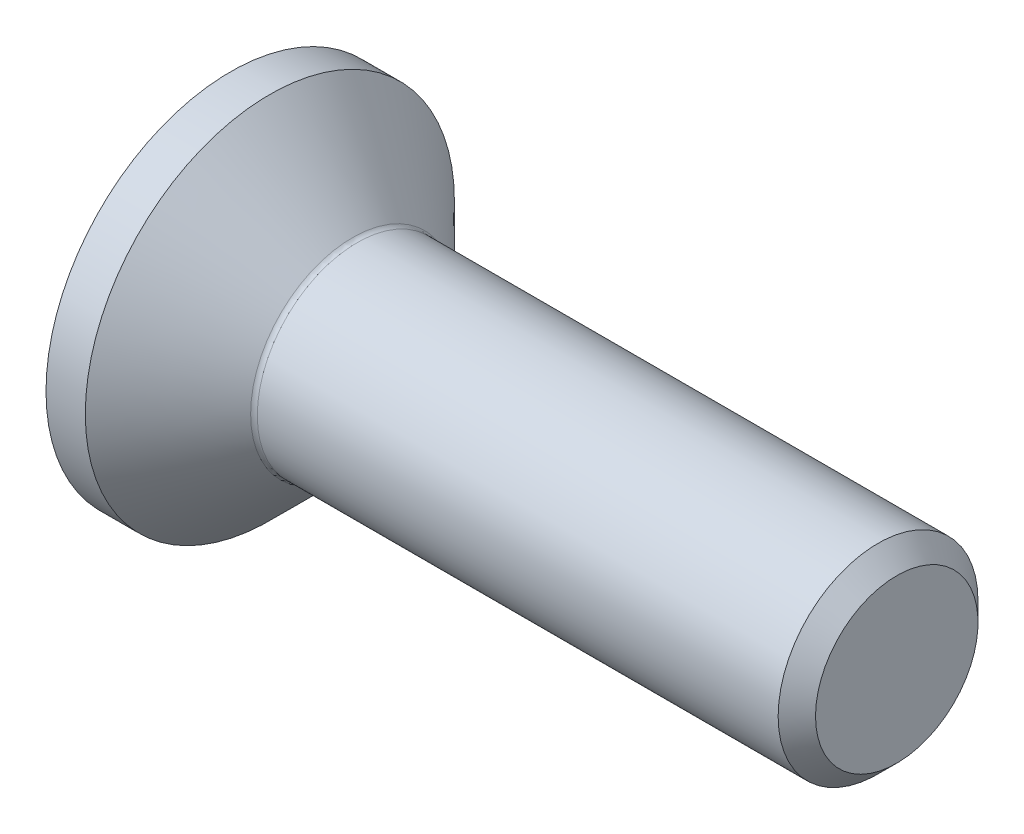
ISO-10303-21;
HEADER;
FILE_DESCRIPTION(('STEP AP214'),'2;1');
FILE_NAME('part.step','',(''),(''),'','','');
FILE_SCHEMA(('AUTOMOTIVE_DESIGN { 1 0 10303 214 1 1 1 1 }'));
ENDSEC;
DATA;
#1=APPLICATION_CONTEXT('core data for automotive mechanical design processes');
#2=APPLICATION_PROTOCOL_DEFINITION('international standard','automotive_design',2000,#1);
#3=PRODUCT_CONTEXT('',#1,'mechanical');
#4=PRODUCT('Part','Part','',(#3));
#5=PRODUCT_RELATED_PRODUCT_CATEGORY('part','',(#4));
#6=PRODUCT_DEFINITION_FORMATION('','',#4);
#7=PRODUCT_DEFINITION_CONTEXT('part definition',#1,'design');
#8=PRODUCT_DEFINITION('design','',#6,#7);
#9=PRODUCT_DEFINITION_SHAPE('','',#8);
#10=(LENGTH_UNIT() NAMED_UNIT(*) SI_UNIT(.MILLI.,.METRE.));
#11=(NAMED_UNIT(*) PLANE_ANGLE_UNIT() SI_UNIT($,.RADIAN.));
#12=(NAMED_UNIT(*) SI_UNIT($,.STERADIAN.) SOLID_ANGLE_UNIT());
#13=UNCERTAINTY_MEASURE_WITH_UNIT(LENGTH_MEASURE(1.E-05),#10,'distance_accuracy_value','');
#14=(GEOMETRIC_REPRESENTATION_CONTEXT(3) GLOBAL_UNCERTAINTY_ASSIGNED_CONTEXT((#13)) GLOBAL_UNIT_ASSIGNED_CONTEXT((#10,
#11,#12)) REPRESENTATION_CONTEXT('',''));
#15=CARTESIAN_POINT('',(0.,0.,0.));
#16=DIRECTION('',(0.,0.,1.));
#17=DIRECTION('',(1.,0.,0.));
#18=AXIS2_PLACEMENT_3D('',#15,#16,#17);
#19=CARTESIAN_POINT('',(0.,0.,0.));
#20=DIRECTION('',(-1.,0.,0.));
#21=DIRECTION('',(0.,0.,1.));
#22=AXIS2_PLACEMENT_3D('',#19,#20,#21);
#23=PLANE('',#22);
#24=CARTESIAN_POINT('',(0.,0.,0.));
#25=DIRECTION('',(-1.,0.,0.));
#26=DIRECTION('',(0.,0.,1.));
#27=AXIS2_PLACEMENT_3D('',#24,#25,#26);
#28=CIRCLE('',#27,2.77);
#29=CARTESIAN_POINT('',(0.,0.,2.77));
#30=VERTEX_POINT('',#29);
#31=EDGE_CURVE('E153',#30,#30,#28,.T.);
#32=ORIENTED_EDGE('',*,*,#31,.T.);
#33=EDGE_LOOP('',(#32));
#34=FACE_BOUND('',#33,.T.);
#35=DIRECTION('',(0.,-0.5,-0.866025403784439));
#36=VECTOR('',#35,1.);
#37=CARTESIAN_POINT('',(0.,-0.577350269189626,1.));
#38=LINE('',#37,#36);
#39=CARTESIAN_POINT('',(0.,-0.577350269189626,1.));
#40=VERTEX_POINT('',#39);
#41=CARTESIAN_POINT('',(0.,-1.15470053837925,0.));
#42=VERTEX_POINT('',#41);
#43=EDGE_CURVE('E119',#40,#42,#38,.T.);
#44=ORIENTED_EDGE('',*,*,#43,.T.);
#45=DIRECTION('',(0.,0.5,-0.866025403784439));
#46=VECTOR('',#45,1.);
#47=CARTESIAN_POINT('',(0.,-1.15470053837925,0.));
#48=LINE('',#47,#46);
#49=CARTESIAN_POINT('',(0.,-0.577350269189626,-1.));
#50=VERTEX_POINT('',#49);
#51=EDGE_CURVE('E50',#42,#50,#48,.T.);
#52=ORIENTED_EDGE('',*,*,#51,.T.);
#53=DIRECTION('',(0.,1.,0.));
#54=VECTOR('',#53,1.);
#55=CARTESIAN_POINT('',(0.,-0.577350269189626,-1.));
#56=LINE('',#55,#54);
#57=CARTESIAN_POINT('',(0.,0.577350269189626,-1.));
#58=VERTEX_POINT('',#57);
#59=EDGE_CURVE('E130',#50,#58,#56,.T.);
#60=ORIENTED_EDGE('',*,*,#59,.T.);
#61=DIRECTION('',(0.,0.5,0.866025403784439));
#62=VECTOR('',#61,1.);
#63=CARTESIAN_POINT('',(0.,0.577350269189626,-1.));
#64=LINE('',#63,#62);
#65=CARTESIAN_POINT('',(0.,1.15470053837925,0.));
#66=VERTEX_POINT('',#65);
#67=EDGE_CURVE('E254',#58,#66,#64,.T.);
#68=ORIENTED_EDGE('',*,*,#67,.T.);
#69=DIRECTION('',(0.,-0.5,0.866025403784438));
#70=VECTOR('',#69,1.);
#71=CARTESIAN_POINT('',(0.,1.15470053837925,0.));
#72=LINE('',#71,#70);
#73=CARTESIAN_POINT('',(0.,0.577350269189626,1.));
#74=VERTEX_POINT('',#73);
#75=EDGE_CURVE('E257',#66,#74,#72,.T.);
#76=ORIENTED_EDGE('',*,*,#75,.T.);
#77=DIRECTION('',(0.,-1.,0.));
#78=VECTOR('',#77,1.);
#79=CARTESIAN_POINT('',(0.,0.577350269189626,1.));
#80=LINE('',#79,#78);
#81=EDGE_CURVE('E260',#74,#40,#80,.T.);
#82=ORIENTED_EDGE('',*,*,#81,.T.);
#83=EDGE_LOOP('',(#44,#52,#60,#68,#76,#82));
#84=FACE_BOUND('',#83,.T.);
#85=ADVANCED_FACE('F35',(#34,#84),#23,.T.);
#86=CARTESIAN_POINT('',(0.,0.,0.));
#87=DIRECTION('',(-1.,0.,0.));
#88=DIRECTION('',(0.,0.,1.));
#89=AXIS2_PLACEMENT_3D('',#86,#87,#88);
#90=CYLINDRICAL_SURFACE('',#89,2.77);
#91=CARTESIAN_POINT('',(0.590000000000007,0.,0.));
#92=DIRECTION('',(-1.,0.,0.));
#93=DIRECTION('',(0.,0.,1.));
#94=AXIS2_PLACEMENT_3D('',#91,#92,#93);
#95=CIRCLE('',#94,2.77);
#96=CARTESIAN_POINT('',(0.590000000000007,0.,2.77));
#97=VERTEX_POINT('',#96);
#98=EDGE_CURVE('E150',#97,#97,#95,.T.);
#99=ORIENTED_EDGE('',*,*,#98,.T.);
#100=EDGE_LOOP('',(#99));
#101=FACE_BOUND('',#100,.T.);
#102=ORIENTED_EDGE('',*,*,#31,.F.);
#103=EDGE_LOOP('',(#102));
#104=FACE_BOUND('',#103,.T.);
#105=ADVANCED_FACE('F174',(#101,#104),#90,.T.);
#106=CARTESIAN_POINT('',(0.590000000000007,0.,0.));
#107=DIRECTION('',(-1.,0.,0.));
#108=DIRECTION('',(0.,0.,1.));
#109=AXIS2_PLACEMENT_3D('',#106,#107,#108);
#110=CONICAL_SURFACE('',#109,2.77,0.78539816339745);
#111=CARTESIAN_POINT('',(1.83071067811866,0.,0.));
#112=DIRECTION('',(-1.,0.,0.));
#113=DIRECTION('',(0.,0.,1.));
#114=AXIS2_PLACEMENT_3D('',#111,#112,#113);
#115=CIRCLE('',#114,1.52928932188134);
#116=CARTESIAN_POINT('',(1.83071067811866,0.,1.52928932188134));
#117=VERTEX_POINT('',#116);
#118=EDGE_CURVE('E43',#117,#117,#115,.T.);
#119=ORIENTED_EDGE('',*,*,#118,.T.);
#120=EDGE_LOOP('',(#119));
#121=FACE_BOUND('',#120,.T.);
#122=ORIENTED_EDGE('',*,*,#98,.F.);
#123=EDGE_LOOP('',(#122));
#124=FACE_BOUND('',#123,.T.);
#125=ADVANCED_FACE('F158',(#121,#124),#110,.T.);
#126=CARTESIAN_POINT('',(0.,0.,0.));
#127=DIRECTION('',(-1.,0.,0.));
#128=DIRECTION('',(0.,0.,1.));
#129=AXIS2_PLACEMENT_3D('',#126,#127,#128);
#130=CYLINDRICAL_SURFACE('',#129,1.5);
#131=CARTESIAN_POINT('',(1.90142135623732,0.,0.));
#132=DIRECTION('',(-1.,0.,0.));
#133=DIRECTION('',(0.,0.,1.));
#134=AXIS2_PLACEMENT_3D('',#131,#132,#133);
#135=CIRCLE('',#134,1.5);
#136=CARTESIAN_POINT('',(1.90142135623732,0.,1.5));
#137=VERTEX_POINT('',#136);
#138=EDGE_CURVE('E11',#137,#137,#135,.F.);
#139=ORIENTED_EDGE('',*,*,#138,.T.);
#140=EDGE_LOOP('',(#139));
#141=FACE_BOUND('',#140,.T.);
#142=CARTESIAN_POINT('',(9.71949999999999,0.,0.));
#143=DIRECTION('',(-1.,0.,0.));
#144=DIRECTION('',(0.,0.,1.));
#145=AXIS2_PLACEMENT_3D('',#142,#143,#144);
#146=CIRCLE('',#145,1.49999999999999);
#147=CARTESIAN_POINT('',(9.71949999999999,0.,1.49999999999999));
#148=VERTEX_POINT('',#147);
#149=EDGE_CURVE('E147',#148,#148,#146,.T.);
#150=ORIENTED_EDGE('',*,*,#149,.T.);
#151=EDGE_LOOP('',(#150));
#152=FACE_BOUND('',#151,.T.);
#153=ADVANCED_FACE('F185',(#141,#152),#130,.T.);
#154=CARTESIAN_POINT('',(10.,0.,0.));
#155=DIRECTION('',(-1.,0.,0.));
#156=DIRECTION('',(0.,0.,1.));
#157=AXIS2_PLACEMENT_3D('',#154,#155,#156);
#158=CONICAL_SURFACE('',#157,1.2195,0.785398163397424);
#159=ORIENTED_EDGE('',*,*,#149,.F.);
#160=EDGE_LOOP('',(#159));
#161=FACE_BOUND('',#160,.T.);
#162=CARTESIAN_POINT('',(10.,0.,0.));
#163=DIRECTION('',(-1.,0.,0.));
#164=DIRECTION('',(0.,0.,1.));
#165=AXIS2_PLACEMENT_3D('',#162,#163,#164);
#166=CIRCLE('',#165,1.2195);
#167=CARTESIAN_POINT('',(10.,0.,1.2195));
#168=VERTEX_POINT('',#167);
#169=EDGE_CURVE('E143',#168,#168,#166,.T.);
#170=ORIENTED_EDGE('',*,*,#169,.T.);
#171=EDGE_LOOP('',(#170));
#172=FACE_BOUND('',#171,.T.);
#173=ADVANCED_FACE('F169',(#161,#172),#158,.T.);
#174=CARTESIAN_POINT('',(10.,1.2195,0.));
#175=DIRECTION('',(1.,0.,0.));
#176=DIRECTION('',(0.,0.,-1.));
#177=AXIS2_PLACEMENT_3D('',#174,#175,#176);
#178=PLANE('',#177);
#179=ORIENTED_EDGE('',*,*,#169,.F.);
#180=EDGE_LOOP('',(#179));
#181=FACE_BOUND('',#180,.T.);
#182=ADVANCED_FACE('F162',(#181),#178,.T.);
#183=CARTESIAN_POINT('',(1.90142135623732,0.,0.));
#184=DIRECTION('',(-1.,0.,0.));
#185=DIRECTION('',(0.,0.,1.));
#186=AXIS2_PLACEMENT_3D('',#183,#184,#185);
#187=TOROIDAL_SURFACE('',#186,1.6,0.1);
#188=ORIENTED_EDGE('',*,*,#138,.F.);
#189=EDGE_LOOP('',(#188));
#190=FACE_BOUND('',#189,.T.);
#191=ORIENTED_EDGE('',*,*,#118,.F.);
#192=EDGE_LOOP('',(#191));
#193=FACE_BOUND('',#192,.T.);
#194=ADVANCED_FACE('F37',(#190,#193),#187,.F.);
#195=CARTESIAN_POINT('',(1.1,-1.15470053837925,0.));
#196=DIRECTION('',(0.,0.866025403784439,0.5));
#197=DIRECTION('',(0.,-0.5,0.866025403784439));
#198=AXIS2_PLACEMENT_3D('',#195,#196,#197);
#199=PLANE('',#198);
#200=ORIENTED_EDGE('',*,*,#51,.F.);
#201=DIRECTION('',(-1.,0.,0.));
#202=VECTOR('',#201,1.);
#203=CARTESIAN_POINT('',(1.1,-1.15470053837925,0.));
#204=LINE('',#203,#202);
#205=CARTESIAN_POINT('',(1.1,-1.15470053837925,0.));
#206=VERTEX_POINT('',#205);
#207=EDGE_CURVE('E251',#206,#42,#204,.T.);
#208=ORIENTED_EDGE('',*,*,#207,.F.);
#209=DIRECTION('',(0.,0.5,-0.866025403784439));
#210=VECTOR('',#209,1.);
#211=CARTESIAN_POINT('',(1.1,-1.15470053837925,0.));
#212=LINE('',#211,#210);
#213=CARTESIAN_POINT('',(1.1,-0.866025403784439,-0.5));
#214=VERTEX_POINT('',#213);
#215=EDGE_CURVE('E115',#206,#214,#212,.T.);
#216=ORIENTED_EDGE('',*,*,#215,.T.);
#217=CARTESIAN_POINT('',(1.1,-0.577350269189626,-1.));
#218=VERTEX_POINT('',#217);
#219=EDGE_CURVE('E111',#214,#218,#212,.T.);
#220=ORIENTED_EDGE('',*,*,#219,.T.);
#221=DIRECTION('',(-1.,0.,0.));
#222=VECTOR('',#221,1.);
#223=CARTESIAN_POINT('',(1.1,-0.577350269189626,-1.));
#224=LINE('',#223,#222);
#225=EDGE_CURVE('E113',#218,#50,#224,.T.);
#226=ORIENTED_EDGE('',*,*,#225,.T.);
#227=EDGE_LOOP('',(#200,#208,#216,#220,#226));
#228=FACE_BOUND('',#227,.T.);
#229=ADVANCED_FACE('F112',(#228),#199,.T.);
#230=CARTESIAN_POINT('',(1.1,-0.577350269189626,-1.));
#231=DIRECTION('',(0.,0.,1.));
#232=DIRECTION('',(1.,0.,0.));
#233=AXIS2_PLACEMENT_3D('',#230,#231,#232);
#234=PLANE('',#233);
#235=ORIENTED_EDGE('',*,*,#59,.F.);
#236=ORIENTED_EDGE('',*,*,#225,.F.);
#237=DIRECTION('',(0.,1.,0.));
#238=VECTOR('',#237,1.);
#239=CARTESIAN_POINT('',(1.1,-0.577350269189626,-1.));
#240=LINE('',#239,#238);
#241=CARTESIAN_POINT('',(1.1,0.,-1.));
#242=VERTEX_POINT('',#241);
#243=EDGE_CURVE('E58',#218,#242,#240,.T.);
#244=ORIENTED_EDGE('',*,*,#243,.T.);
#245=CARTESIAN_POINT('',(1.1,0.577350269189626,-1.));
#246=VERTEX_POINT('',#245);
#247=EDGE_CURVE('E125',#242,#246,#240,.T.);
#248=ORIENTED_EDGE('',*,*,#247,.T.);
#249=DIRECTION('',(-1.,0.,0.));
#250=VECTOR('',#249,1.);
#251=CARTESIAN_POINT('',(1.1,0.577350269189626,-1.));
#252=LINE('',#251,#250);
#253=EDGE_CURVE('E132',#246,#58,#252,.T.);
#254=ORIENTED_EDGE('',*,*,#253,.T.);
#255=EDGE_LOOP('',(#235,#236,#244,#248,#254));
#256=FACE_BOUND('',#255,.T.);
#257=ADVANCED_FACE('F127',(#256),#234,.T.);
#258=CARTESIAN_POINT('',(1.1,0.577350269189626,-1.));
#259=DIRECTION('',(0.,-0.866025403784439,0.5));
#260=DIRECTION('',(0.,-0.5,-0.866025403784439));
#261=AXIS2_PLACEMENT_3D('',#258,#259,#260);
#262=PLANE('',#261);
#263=ORIENTED_EDGE('',*,*,#67,.F.);
#264=ORIENTED_EDGE('',*,*,#253,.F.);
#265=DIRECTION('',(0.,0.5,0.866025403784439));
#266=VECTOR('',#265,1.);
#267=CARTESIAN_POINT('',(1.1,0.577350269189626,-1.));
#268=LINE('',#267,#266);
#269=CARTESIAN_POINT('',(1.1,0.866025403784438,-0.5));
#270=VERTEX_POINT('',#269);
#271=EDGE_CURVE('E232',#246,#270,#268,.T.);
#272=ORIENTED_EDGE('',*,*,#271,.T.);
#273=CARTESIAN_POINT('',(1.1,1.15470053837925,0.));
#274=VERTEX_POINT('',#273);
#275=EDGE_CURVE('E124',#270,#274,#268,.T.);
#276=ORIENTED_EDGE('',*,*,#275,.T.);
#277=DIRECTION('',(-1.,0.,0.));
#278=VECTOR('',#277,1.);
#279=CARTESIAN_POINT('',(1.1,1.15470053837925,0.));
#280=LINE('',#279,#278);
#281=EDGE_CURVE('E138',#274,#66,#280,.T.);
#282=ORIENTED_EDGE('',*,*,#281,.T.);
#283=EDGE_LOOP('',(#263,#264,#272,#276,#282));
#284=FACE_BOUND('',#283,.T.);
#285=ADVANCED_FACE('F199',(#284),#262,.T.);
#286=CARTESIAN_POINT('',(1.1,1.15470053837925,0.));
#287=DIRECTION('',(0.,-0.866025403784439,-0.5));
#288=DIRECTION('',(0.,0.5,-0.866025403784439));
#289=AXIS2_PLACEMENT_3D('',#286,#287,#288);
#290=PLANE('',#289);
#291=ORIENTED_EDGE('',*,*,#75,.F.);
#292=ORIENTED_EDGE('',*,*,#281,.F.);
#293=DIRECTION('',(0.,-0.5,0.866025403784438));
#294=VECTOR('',#293,1.);
#295=CARTESIAN_POINT('',(1.1,1.15470053837925,0.));
#296=LINE('',#295,#294);
#297=CARTESIAN_POINT('',(1.1,0.866025403784438,0.5));
#298=VERTEX_POINT('',#297);
#299=EDGE_CURVE('E239',#274,#298,#296,.T.);
#300=ORIENTED_EDGE('',*,*,#299,.T.);
#301=CARTESIAN_POINT('',(1.1,0.577350269189626,1.));
#302=VERTEX_POINT('',#301);
#303=EDGE_CURVE('E237',#298,#302,#296,.T.);
#304=ORIENTED_EDGE('',*,*,#303,.T.);
#305=DIRECTION('',(-1.,0.,0.));
#306=VECTOR('',#305,1.);
#307=CARTESIAN_POINT('',(1.1,0.577350269189626,1.));
#308=LINE('',#307,#306);
#309=EDGE_CURVE('E269',#302,#74,#308,.T.);
#310=ORIENTED_EDGE('',*,*,#309,.T.);
#311=EDGE_LOOP('',(#291,#292,#300,#304,#310));
#312=FACE_BOUND('',#311,.T.);
#313=ADVANCED_FACE('F202',(#312),#290,.T.);
#314=CARTESIAN_POINT('',(1.1,0.577350269189626,1.));
#315=DIRECTION('',(0.,0.,-1.));
#316=DIRECTION('',(-1.,0.,0.));
#317=AXIS2_PLACEMENT_3D('',#314,#315,#316);
#318=PLANE('',#317);
#319=ORIENTED_EDGE('',*,*,#81,.F.);
#320=ORIENTED_EDGE('',*,*,#309,.F.);
#321=DIRECTION('',(0.,-1.,0.));
#322=VECTOR('',#321,1.);
#323=CARTESIAN_POINT('',(1.1,0.577350269189626,1.));
#324=LINE('',#323,#322);
#325=CARTESIAN_POINT('',(1.1,0.,1.));
#326=VERTEX_POINT('',#325);
#327=EDGE_CURVE('E244',#302,#326,#324,.T.);
#328=ORIENTED_EDGE('',*,*,#327,.T.);
#329=CARTESIAN_POINT('',(1.1,-0.577350269189626,1.));
#330=VERTEX_POINT('',#329);
#331=EDGE_CURVE('E243',#326,#330,#324,.T.);
#332=ORIENTED_EDGE('',*,*,#331,.T.);
#333=DIRECTION('',(-1.,0.,0.));
#334=VECTOR('',#333,1.);
#335=CARTESIAN_POINT('',(1.1,-0.577350269189626,1.));
#336=LINE('',#335,#334);
#337=EDGE_CURVE('E266',#330,#40,#336,.T.);
#338=ORIENTED_EDGE('',*,*,#337,.T.);
#339=EDGE_LOOP('',(#319,#320,#328,#332,#338));
#340=FACE_BOUND('',#339,.T.);
#341=ADVANCED_FACE('F206',(#340),#318,.T.);
#342=CARTESIAN_POINT('',(1.1,-0.577350269189626,1.));
#343=DIRECTION('',(0.,0.866025403784439,-0.5));
#344=DIRECTION('',(0.,0.5,0.866025403784439));
#345=AXIS2_PLACEMENT_3D('',#342,#343,#344);
#346=PLANE('',#345);
#347=ORIENTED_EDGE('',*,*,#43,.F.);
#348=ORIENTED_EDGE('',*,*,#337,.F.);
#349=DIRECTION('',(0.,-0.5,-0.866025403784439));
#350=VECTOR('',#349,1.);
#351=CARTESIAN_POINT('',(1.1,-0.577350269189626,1.));
#352=LINE('',#351,#350);
#353=CARTESIAN_POINT('',(1.1,-0.866025403784439,0.5));
#354=VERTEX_POINT('',#353);
#355=EDGE_CURVE('E248',#330,#354,#352,.T.);
#356=ORIENTED_EDGE('',*,*,#355,.T.);
#357=EDGE_CURVE('E247',#354,#206,#352,.T.);
#358=ORIENTED_EDGE('',*,*,#357,.T.);
#359=ORIENTED_EDGE('',*,*,#207,.T.);
#360=EDGE_LOOP('',(#347,#348,#356,#358,#359));
#361=FACE_BOUND('',#360,.T.);
#362=ADVANCED_FACE('F210',(#361),#346,.T.);
#363=CARTESIAN_POINT('',(1.1,-0.577350269189626,-1.));
#364=DIRECTION('',(1.,0.,0.));
#365=DIRECTION('',(0.,0.,-1.));
#366=AXIS2_PLACEMENT_3D('',#363,#364,#365);
#367=PLANE('',#366);
#368=ORIENTED_EDGE('',*,*,#243,.F.);
#369=ORIENTED_EDGE('',*,*,#219,.F.);
#370=CARTESIAN_POINT('',(1.1,0.,0.));
#371=DIRECTION('',(-1.,0.,0.));
#372=DIRECTION('',(0.,0.,1.));
#373=AXIS2_PLACEMENT_3D('',#370,#371,#372);
#374=CIRCLE('',#373,1.);
#375=EDGE_CURVE('E122',#242,#214,#374,.T.);
#376=ORIENTED_EDGE('',*,*,#375,.F.);
#377=EDGE_LOOP('',(#368,#369,#376));
#378=FACE_BOUND('',#377,.T.);
#379=ADVANCED_FACE('F121',(#378),#367,.F.);
#380=ORIENTED_EDGE('',*,*,#215,.F.);
#381=ORIENTED_EDGE('',*,*,#357,.F.);
#382=EDGE_CURVE('E135',#214,#354,#374,.T.);
#383=ORIENTED_EDGE('',*,*,#382,.F.);
#384=EDGE_LOOP('',(#380,#381,#383));
#385=FACE_BOUND('',#384,.T.);
#386=ADVANCED_FACE('F216',(#385),#367,.F.);
#387=ORIENTED_EDGE('',*,*,#355,.F.);
#388=ORIENTED_EDGE('',*,*,#331,.F.);
#389=EDGE_CURVE('E131',#354,#326,#374,.T.);
#390=ORIENTED_EDGE('',*,*,#389,.F.);
#391=EDGE_LOOP('',(#387,#388,#390));
#392=FACE_BOUND('',#391,.T.);
#393=ADVANCED_FACE('F220',(#392),#367,.F.);
#394=ORIENTED_EDGE('',*,*,#327,.F.);
#395=ORIENTED_EDGE('',*,*,#303,.F.);
#396=EDGE_CURVE('E137',#326,#298,#374,.T.);
#397=ORIENTED_EDGE('',*,*,#396,.F.);
#398=EDGE_LOOP('',(#394,#395,#397));
#399=FACE_BOUND('',#398,.T.);
#400=ADVANCED_FACE('F228',(#399),#367,.F.);
#401=ORIENTED_EDGE('',*,*,#299,.F.);
#402=ORIENTED_EDGE('',*,*,#275,.F.);
#403=EDGE_CURVE('E144',#298,#270,#374,.T.);
#404=ORIENTED_EDGE('',*,*,#403,.F.);
#405=EDGE_LOOP('',(#401,#402,#404));
#406=FACE_BOUND('',#405,.T.);
#407=ADVANCED_FACE('F223',(#406),#367,.F.);
#408=ORIENTED_EDGE('',*,*,#271,.F.);
#409=ORIENTED_EDGE('',*,*,#247,.F.);
#410=EDGE_CURVE('E233',#270,#242,#374,.T.);
#411=ORIENTED_EDGE('',*,*,#410,.F.);
#412=EDGE_LOOP('',(#408,#409,#411));
#413=FACE_BOUND('',#412,.T.);
#414=ADVANCED_FACE('F194',(#413),#367,.F.);
#415=CARTESIAN_POINT('',(1.1,0.,0.));
#416=DIRECTION('',(-1.,0.,0.));
#417=DIRECTION('',(0.,0.,1.));
#418=AXIS2_PLACEMENT_3D('',#415,#416,#417);
#419=CONICAL_SURFACE('',#418,1.,1.04719755119659);
#420=CARTESIAN_POINT('',(1.67735026918963,0.,0.));
#421=VERTEX_POINT('',#420);
#422=VERTEX_LOOP('',#421);
#423=FACE_BOUND('',#422,.T.);
#424=ORIENTED_EDGE('',*,*,#396,.T.);
#425=ORIENTED_EDGE('',*,*,#403,.T.);
#426=ORIENTED_EDGE('',*,*,#410,.T.);
#427=ORIENTED_EDGE('',*,*,#375,.T.);
#428=ORIENTED_EDGE('',*,*,#382,.T.);
#429=ORIENTED_EDGE('',*,*,#389,.T.);
#430=EDGE_LOOP('',(#424,#425,#426,#427,#428,#429));
#431=FACE_BOUND('',#430,.T.);
#432=ADVANCED_FACE('F192',(#423,#431),#419,.F.);
#433=CLOSED_SHELL('',(#85,#105,#125,#153,#173,#182,#194,#229,#257,#285,#313,#341,#362,#379,#386,
#393,#400,#407,#414,#432));
#434=MANIFOLD_SOLID_BREP('B2',#433);
#435=ADVANCED_BREP_SHAPE_REPRESENTATION('',(#18,#434),#14);
#436=SHAPE_DEFINITION_REPRESENTATION(#9,#435);
ENDSEC;
END-ISO-10303-21;
